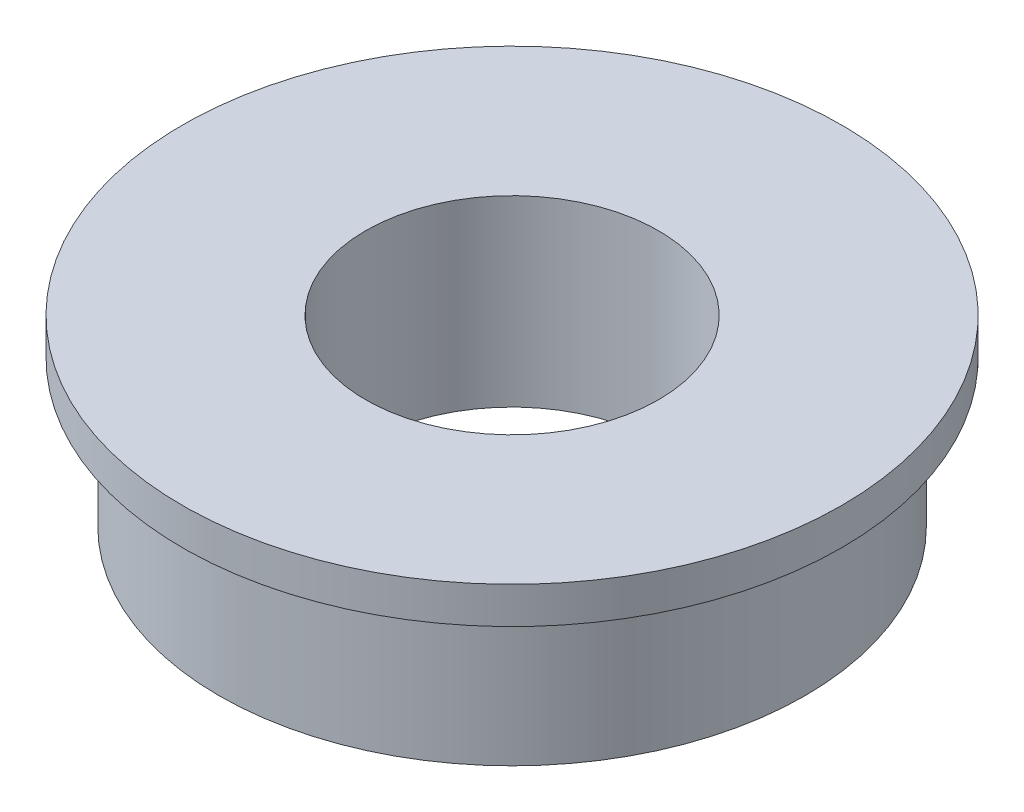
ISO-10303-21;
HEADER;
FILE_DESCRIPTION(('STEP AP214'),'2;1');
FILE_NAME('part.step','',(''),(''),'','','');
FILE_SCHEMA(('AUTOMOTIVE_DESIGN { 1 0 10303 214 1 1 1 1 }'));
ENDSEC;
DATA;
#1=APPLICATION_CONTEXT('core data for automotive mechanical design processes');
#2=APPLICATION_PROTOCOL_DEFINITION('international standard','automotive_design',2000,#1);
#3=PRODUCT_CONTEXT('',#1,'mechanical');
#4=PRODUCT('Part','Part','',(#3));
#5=PRODUCT_RELATED_PRODUCT_CATEGORY('part','',(#4));
#6=PRODUCT_DEFINITION_FORMATION('','',#4);
#7=PRODUCT_DEFINITION_CONTEXT('part definition',#1,'design');
#8=PRODUCT_DEFINITION('design','',#6,#7);
#9=PRODUCT_DEFINITION_SHAPE('','',#8);
#10=(LENGTH_UNIT() NAMED_UNIT(*) SI_UNIT(.MILLI.,.METRE.));
#11=(NAMED_UNIT(*) PLANE_ANGLE_UNIT() SI_UNIT($,.RADIAN.));
#12=(NAMED_UNIT(*) SI_UNIT($,.STERADIAN.) SOLID_ANGLE_UNIT());
#13=UNCERTAINTY_MEASURE_WITH_UNIT(LENGTH_MEASURE(1.E-05),#10,'distance_accuracy_value','');
#14=(GEOMETRIC_REPRESENTATION_CONTEXT(3) GLOBAL_UNCERTAINTY_ASSIGNED_CONTEXT((#13)) GLOBAL_UNIT_ASSIGNED_CONTEXT((#10,
#11,#12)) REPRESENTATION_CONTEXT('',''));
#15=CARTESIAN_POINT('',(0.,0.,0.));
#16=DIRECTION('',(0.,0.,1.));
#17=DIRECTION('',(1.,0.,0.));
#18=AXIS2_PLACEMENT_3D('',#15,#16,#17);
#19=CARTESIAN_POINT('',(0.,-8.4874881514484,0.));
#20=DIRECTION('',(0.,-1.,0.));
#21=DIRECTION('',(1.,0.,0.));
#22=AXIS2_PLACEMENT_3D('',#19,#20,#21);
#23=CYLINDRICAL_SURFACE('',#22,8.00000000000001);
#24=CARTESIAN_POINT('',(0.,3.30123182021748,0.));
#25=DIRECTION('',(0.,-1.,0.));
#26=DIRECTION('',(1.,0.,0.));
#27=AXIS2_PLACEMENT_3D('',#24,#25,#26);
#28=CIRCLE('',#27,8.00000000000001);
#29=CARTESIAN_POINT('',(8.,3.30123182021751,0.));
#30=VERTEX_POINT('',#29);
#31=EDGE_CURVE('E64',#30,#30,#28,.T.);
#32=ORIENTED_EDGE('',*,*,#31,.T.);
#33=EDGE_LOOP('',(#32));
#34=FACE_BOUND('',#33,.T.);
#35=CARTESIAN_POINT('',(0.,-0.698768179782518,0.));
#36=DIRECTION('',(0.,-1.,0.));
#37=DIRECTION('',(1.,0.,0.));
#38=AXIS2_PLACEMENT_3D('',#35,#36,#37);
#39=CIRCLE('',#38,8.);
#40=CARTESIAN_POINT('',(8.,-0.69876817978249,0.));
#41=VERTEX_POINT('',#40);
#42=EDGE_CURVE('E10',#41,#41,#39,.T.);
#43=ORIENTED_EDGE('',*,*,#42,.F.);
#44=EDGE_LOOP('',(#43));
#45=FACE_BOUND('',#44,.T.);
#46=ADVANCED_FACE('F37',(#34,#45),#23,.T.);
#47=CARTESIAN_POINT('',(8.,-0.698768179782484,0.));
#48=DIRECTION('',(0.,-1.,0.));
#49=DIRECTION('',(1.,0.,0.));
#50=AXIS2_PLACEMENT_3D('',#47,#48,#49);
#51=PLANE('',#50);
#52=ORIENTED_EDGE('',*,*,#42,.T.);
#53=EDGE_LOOP('',(#52));
#54=FACE_BOUND('',#53,.T.);
#55=CARTESIAN_POINT('',(0.,-0.698768179782505,0.));
#56=DIRECTION('',(0.,-1.,0.));
#57=DIRECTION('',(1.,0.,0.));
#58=AXIS2_PLACEMENT_3D('',#55,#56,#57);
#59=CIRCLE('',#58,4.);
#60=CARTESIAN_POINT('',(4.,-0.698768179782491,0.));
#61=VERTEX_POINT('',#60);
#62=EDGE_CURVE('E44',#61,#61,#59,.T.);
#63=ORIENTED_EDGE('',*,*,#62,.F.);
#64=EDGE_LOOP('',(#63));
#65=FACE_BOUND('',#64,.T.);
#66=ADVANCED_FACE('F83',(#54,#65),#51,.T.);
#67=CARTESIAN_POINT('',(0.,-8.4874881514484,0.));
#68=DIRECTION('',(0.,-1.,0.));
#69=DIRECTION('',(1.,0.,0.));
#70=AXIS2_PLACEMENT_3D('',#67,#68,#69);
#71=CYLINDRICAL_SURFACE('',#70,4.00000000000001);
#72=ORIENTED_EDGE('',*,*,#62,.T.);
#73=EDGE_LOOP('',(#72));
#74=FACE_BOUND('',#73,.T.);
#75=CARTESIAN_POINT('',(0.,4.30123182021749,0.));
#76=DIRECTION('',(0.,-1.,0.));
#77=DIRECTION('',(1.,0.,0.));
#78=AXIS2_PLACEMENT_3D('',#75,#76,#77);
#79=CIRCLE('',#78,4.00000000000002);
#80=CARTESIAN_POINT('',(4.,4.30123182021751,0.));
#81=VERTEX_POINT('',#80);
#82=EDGE_CURVE('E49',#81,#81,#79,.T.);
#83=ORIENTED_EDGE('',*,*,#82,.F.);
#84=EDGE_LOOP('',(#83));
#85=FACE_BOUND('',#84,.T.);
#86=ADVANCED_FACE('F87',(#74,#85),#71,.F.);
#87=CARTESIAN_POINT('',(8.,4.30123182021751,0.));
#88=DIRECTION('',(0.,1.,0.));
#89=DIRECTION('',(-1.,0.,0.));
#90=AXIS2_PLACEMENT_3D('',#87,#88,#89);
#91=PLANE('',#90);
#92=ORIENTED_EDGE('',*,*,#82,.T.);
#93=EDGE_LOOP('',(#92));
#94=FACE_BOUND('',#93,.T.);
#95=CARTESIAN_POINT('',(0.,4.30123182021748,0.));
#96=DIRECTION('',(0.,-1.,0.));
#97=DIRECTION('',(1.,0.,0.));
#98=AXIS2_PLACEMENT_3D('',#95,#96,#97);
#99=CIRCLE('',#98,9.00000000000001);
#100=CARTESIAN_POINT('',(9.,4.30123182021751,0.));
#101=VERTEX_POINT('',#100);
#102=EDGE_CURVE('E54',#101,#101,#99,.T.);
#103=ORIENTED_EDGE('',*,*,#102,.F.);
#104=EDGE_LOOP('',(#103));
#105=FACE_BOUND('',#104,.T.);
#106=ADVANCED_FACE('F79',(#94,#105),#91,.T.);
#107=CARTESIAN_POINT('',(0.,-8.4874881514484,0.));
#108=DIRECTION('',(0.,-1.,0.));
#109=DIRECTION('',(1.,0.,0.));
#110=AXIS2_PLACEMENT_3D('',#107,#108,#109);
#111=CYLINDRICAL_SURFACE('',#110,9.00000000000001);
#112=ORIENTED_EDGE('',*,*,#102,.T.);
#113=EDGE_LOOP('',(#112));
#114=FACE_BOUND('',#113,.T.);
#115=CARTESIAN_POINT('',(0.,3.30123182021748,0.));
#116=DIRECTION('',(0.,-1.,0.));
#117=DIRECTION('',(1.,0.,0.));
#118=AXIS2_PLACEMENT_3D('',#115,#116,#117);
#119=CIRCLE('',#118,9.00000000000001);
#120=CARTESIAN_POINT('',(9.,3.30123182021751,0.));
#121=VERTEX_POINT('',#120);
#122=EDGE_CURVE('E60',#121,#121,#119,.T.);
#123=ORIENTED_EDGE('',*,*,#122,.F.);
#124=EDGE_LOOP('',(#123));
#125=FACE_BOUND('',#124,.T.);
#126=ADVANCED_FACE('F73',(#114,#125),#111,.T.);
#127=CARTESIAN_POINT('',(8.,3.30123182021751,0.));
#128=DIRECTION('',(0.,-1.,0.));
#129=DIRECTION('',(1.,0.,0.));
#130=AXIS2_PLACEMENT_3D('',#127,#128,#129);
#131=PLANE('',#130);
#132=ORIENTED_EDGE('',*,*,#122,.T.);
#133=EDGE_LOOP('',(#132));
#134=FACE_BOUND('',#133,.T.);
#135=ORIENTED_EDGE('',*,*,#31,.F.);
#136=EDGE_LOOP('',(#135));
#137=FACE_BOUND('',#136,.T.);
#138=ADVANCED_FACE('F71',(#134,#137),#131,.T.);
#139=CLOSED_SHELL('',(#46,#66,#86,#106,#126,#138));
#140=MANIFOLD_SOLID_BREP('B2',#139);
#141=ADVANCED_BREP_SHAPE_REPRESENTATION('',(#18,#140),#14);
#142=SHAPE_DEFINITION_REPRESENTATION(#9,#141);
ENDSEC;
END-ISO-10303-21;
